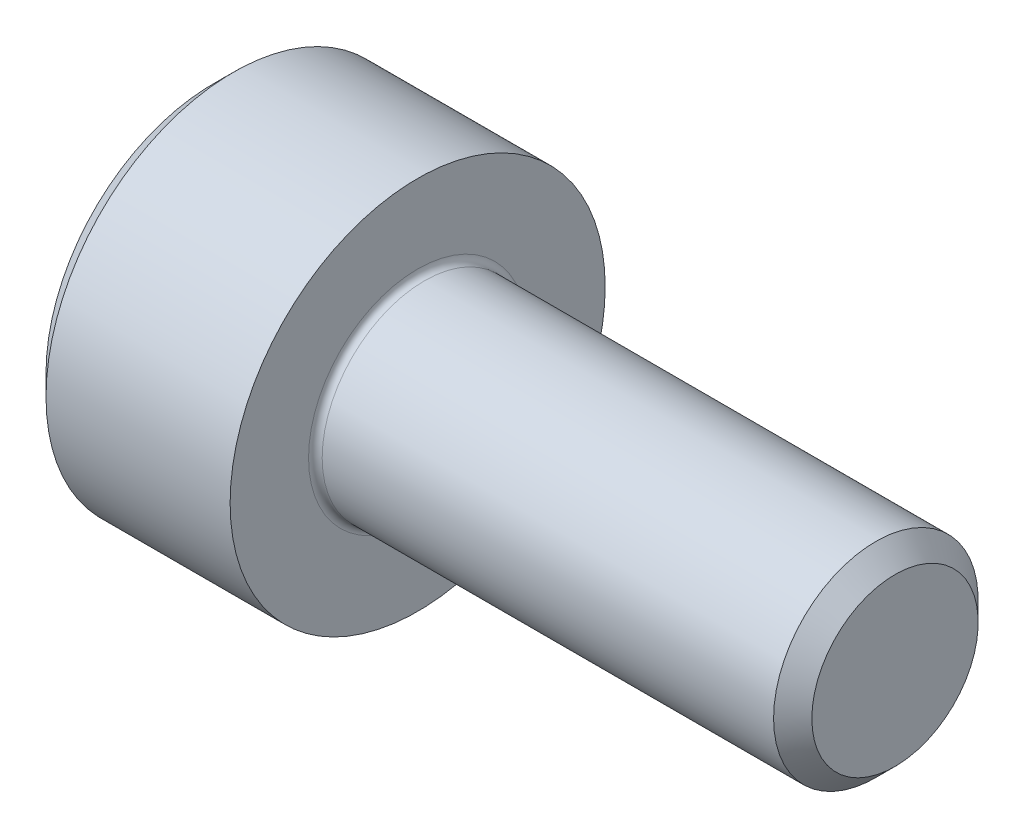
ISO-10303-21;
HEADER;
FILE_DESCRIPTION(('STEP AP214'),'2;1');
FILE_NAME('part.step','',(''),(''),'','','');
FILE_SCHEMA(('AUTOMOTIVE_DESIGN { 1 0 10303 214 1 1 1 1 }'));
ENDSEC;
DATA;
#1=APPLICATION_CONTEXT('core data for automotive mechanical design processes');
#2=APPLICATION_PROTOCOL_DEFINITION('international standard','automotive_design',2000,#1);
#3=PRODUCT_CONTEXT('',#1,'mechanical');
#4=PRODUCT('Part','Part','',(#3));
#5=PRODUCT_RELATED_PRODUCT_CATEGORY('part','',(#4));
#6=PRODUCT_DEFINITION_FORMATION('','',#4);
#7=PRODUCT_DEFINITION_CONTEXT('part definition',#1,'design');
#8=PRODUCT_DEFINITION('design','',#6,#7);
#9=PRODUCT_DEFINITION_SHAPE('','',#8);
#10=(LENGTH_UNIT() NAMED_UNIT(*) SI_UNIT(.MILLI.,.METRE.));
#11=(NAMED_UNIT(*) PLANE_ANGLE_UNIT() SI_UNIT($,.RADIAN.));
#12=(NAMED_UNIT(*) SI_UNIT($,.STERADIAN.) SOLID_ANGLE_UNIT());
#13=UNCERTAINTY_MEASURE_WITH_UNIT(LENGTH_MEASURE(1.E-05),#10,'distance_accuracy_value','');
#14=(GEOMETRIC_REPRESENTATION_CONTEXT(3) GLOBAL_UNCERTAINTY_ASSIGNED_CONTEXT((#13)) GLOBAL_UNIT_ASSIGNED_CONTEXT((#10,
#11,#12)) REPRESENTATION_CONTEXT('',''));
#15=CARTESIAN_POINT('',(0.,0.,0.));
#16=DIRECTION('',(0.,0.,1.));
#17=DIRECTION('',(1.,0.,0.));
#18=AXIS2_PLACEMENT_3D('',#15,#16,#17);
#19=CARTESIAN_POINT('',(0.,0.,0.));
#20=DIRECTION('',(-1.,0.,0.));
#21=DIRECTION('',(0.,0.,1.));
#22=AXIS2_PLACEMENT_3D('',#19,#20,#21);
#23=PLANE('',#22);
#24=DIRECTION('',(0.,-0.5,0.866025403784439));
#25=VECTOR('',#24,1.);
#26=CARTESIAN_POINT('',(0.,1.47801668912544,0.));
#27=LINE('',#26,#25);
#28=CARTESIAN_POINT('',(0.,1.47801668912544,0.));
#29=VERTEX_POINT('',#28);
#30=CARTESIAN_POINT('',(0.,0.739008344562719,1.28));
#31=VERTEX_POINT('',#30);
#32=EDGE_CURVE('E261',#29,#31,#27,.T.);
#33=ORIENTED_EDGE('',*,*,#32,.T.);
#34=DIRECTION('',(0.,1.,0.));
#35=VECTOR('',#34,1.);
#36=CARTESIAN_POINT('',(0.,-0.739008344562723,1.28));
#37=LINE('',#36,#35);
#38=CARTESIAN_POINT('',(0.,-0.739008344562723,1.28));
#39=VERTEX_POINT('',#38);
#40=EDGE_CURVE('E132',#39,#31,#37,.T.);
#41=ORIENTED_EDGE('',*,*,#40,.F.);
#42=DIRECTION('',(0.,-0.500000000000001,-0.866025403784438));
#43=VECTOR('',#42,1.);
#44=CARTESIAN_POINT('',(0.,-0.739008344562723,1.28));
#45=LINE('',#44,#43);
#46=CARTESIAN_POINT('',(0.,-1.47801668912545,0.));
#47=VERTEX_POINT('',#46);
#48=EDGE_CURVE('E264',#39,#47,#45,.T.);
#49=ORIENTED_EDGE('',*,*,#48,.T.);
#50=DIRECTION('',(0.,0.5,-0.866025403784439));
#51=VECTOR('',#50,1.);
#52=CARTESIAN_POINT('',(0.,-1.47801668912545,0.));
#53=LINE('',#52,#51);
#54=CARTESIAN_POINT('',(0.,-0.739008344562725,-1.28));
#55=VERTEX_POINT('',#54);
#56=EDGE_CURVE('E267',#47,#55,#53,.T.);
#57=ORIENTED_EDGE('',*,*,#56,.T.);
#58=DIRECTION('',(0.,-1.,0.));
#59=VECTOR('',#58,1.);
#60=CARTESIAN_POINT('',(0.,0.739008344562717,-1.28));
#61=LINE('',#60,#59);
#62=CARTESIAN_POINT('',(0.,0.739008344562717,-1.28));
#63=VERTEX_POINT('',#62);
#64=EDGE_CURVE('E270',#63,#55,#61,.T.);
#65=ORIENTED_EDGE('',*,*,#64,.F.);
#66=DIRECTION('',(0.,-0.500000000000001,-0.866025403784438));
#67=VECTOR('',#66,1.);
#68=CARTESIAN_POINT('',(0.,1.47801668912544,0.));
#69=LINE('',#68,#67);
#70=EDGE_CURVE('E127',#29,#63,#69,.T.);
#71=ORIENTED_EDGE('',*,*,#70,.F.);
#72=EDGE_LOOP('',(#33,#41,#49,#57,#65,#71));
#73=FACE_BOUND('',#72,.T.);
#74=CARTESIAN_POINT('',(0.,0.,0.));
#75=DIRECTION('',(-1.,0.,0.));
#76=DIRECTION('',(0.,0.,1.));
#77=AXIS2_PLACEMENT_3D('',#74,#75,#76);
#78=CIRCLE('',#77,2.45);
#79=CARTESIAN_POINT('',(0.,0.,2.45));
#80=VERTEX_POINT('',#79);
#81=EDGE_CURVE('E156',#80,#80,#78,.T.);
#82=ORIENTED_EDGE('',*,*,#81,.T.);
#83=EDGE_LOOP('',(#82));
#84=FACE_BOUND('',#83,.T.);
#85=ADVANCED_FACE('F36',(#73,#84),#23,.T.);
#86=CARTESIAN_POINT('',(0.,0.,0.));
#87=DIRECTION('',(1.,0.,0.));
#88=DIRECTION('',(0.,0.,-1.));
#89=AXIS2_PLACEMENT_3D('',#86,#87,#88);
#90=CONICAL_SURFACE('',#89,2.45,0.785398163397447);
#91=CARTESIAN_POINT('',(0.300000000000002,0.,0.));
#92=DIRECTION('',(-1.,0.,0.));
#93=DIRECTION('',(0.,0.,1.));
#94=AXIS2_PLACEMENT_3D('',#91,#92,#93);
#95=CIRCLE('',#94,2.75);
#96=CARTESIAN_POINT('',(0.300000000000002,0.,2.75));
#97=VERTEX_POINT('',#96);
#98=EDGE_CURVE('E153',#97,#97,#95,.T.);
#99=ORIENTED_EDGE('',*,*,#98,.T.);
#100=EDGE_LOOP('',(#99));
#101=FACE_BOUND('',#100,.T.);
#102=ORIENTED_EDGE('',*,*,#81,.F.);
#103=EDGE_LOOP('',(#102));
#104=FACE_BOUND('',#103,.T.);
#105=ADVANCED_FACE('F177',(#101,#104),#90,.T.);
#106=CARTESIAN_POINT('',(-31.75,0.,0.));
#107=DIRECTION('',(-1.,0.,0.));
#108=DIRECTION('',(0.,0.,1.));
#109=AXIS2_PLACEMENT_3D('',#106,#107,#108);
#110=CYLINDRICAL_SURFACE('',#109,2.75);
#111=CARTESIAN_POINT('',(3.,0.,0.));
#112=DIRECTION('',(-1.,0.,0.));
#113=DIRECTION('',(0.,0.,1.));
#114=AXIS2_PLACEMENT_3D('',#111,#112,#113);
#115=CIRCLE('',#114,2.75);
#116=CARTESIAN_POINT('',(3.,0.,2.75));
#117=VERTEX_POINT('',#116);
#118=EDGE_CURVE('E150',#117,#117,#115,.T.);
#119=ORIENTED_EDGE('',*,*,#118,.T.);
#120=EDGE_LOOP('',(#119));
#121=FACE_BOUND('',#120,.T.);
#122=ORIENTED_EDGE('',*,*,#98,.F.);
#123=EDGE_LOOP('',(#122));
#124=FACE_BOUND('',#123,.T.);
#125=ADVANCED_FACE('F182',(#121,#124),#110,.T.);
#126=CARTESIAN_POINT('',(3.,2.75,0.));
#127=DIRECTION('',(1.,0.,0.));
#128=DIRECTION('',(0.,0.,-1.));
#129=AXIS2_PLACEMENT_3D('',#126,#127,#128);
#130=PLANE('',#129);
#131=CARTESIAN_POINT('',(3.,0.,0.));
#132=DIRECTION('',(1.,0.,0.));
#133=DIRECTION('',(0.,0.,-1.));
#134=AXIS2_PLACEMENT_3D('',#131,#132,#133);
#135=CIRCLE('',#134,1.59999999999997);
#136=CARTESIAN_POINT('',(3.,0.,-1.59999999999997));
#137=VERTEX_POINT('',#136);
#138=EDGE_CURVE('E44',#137,#137,#135,.F.);
#139=ORIENTED_EDGE('',*,*,#138,.T.);
#140=EDGE_LOOP('',(#139));
#141=FACE_BOUND('',#140,.T.);
#142=ORIENTED_EDGE('',*,*,#118,.F.);
#143=EDGE_LOOP('',(#142));
#144=FACE_BOUND('',#143,.T.);
#145=ADVANCED_FACE('F161',(#141,#144),#130,.T.);
#146=CARTESIAN_POINT('',(-31.75,0.,0.));
#147=DIRECTION('',(-1.,0.,0.));
#148=DIRECTION('',(0.,0.,1.));
#149=AXIS2_PLACEMENT_3D('',#146,#147,#148);
#150=CYLINDRICAL_SURFACE('',#149,1.49999999999997);
#151=CARTESIAN_POINT('',(3.1,0.,0.));
#152=DIRECTION('',(1.,0.,0.));
#153=DIRECTION('',(0.,0.,-1.));
#154=AXIS2_PLACEMENT_3D('',#151,#152,#153);
#155=CIRCLE('',#154,1.49999999999997);
#156=CARTESIAN_POINT('',(3.1,0.,-1.49999999999997));
#157=VERTEX_POINT('',#156);
#158=EDGE_CURVE('E11',#157,#157,#155,.T.);
#159=ORIENTED_EDGE('',*,*,#158,.T.);
#160=EDGE_LOOP('',(#159));
#161=FACE_BOUND('',#160,.T.);
#162=CARTESIAN_POINT('',(9.71949999999995,0.,0.));
#163=DIRECTION('',(-1.,0.,0.));
#164=DIRECTION('',(0.,0.,1.));
#165=AXIS2_PLACEMENT_3D('',#162,#163,#164);
#166=CIRCLE('',#165,1.49999999999994);
#167=CARTESIAN_POINT('',(9.71949999999995,0.,1.49999999999994));
#168=VERTEX_POINT('',#167);
#169=EDGE_CURVE('E147',#168,#168,#166,.T.);
#170=ORIENTED_EDGE('',*,*,#169,.T.);
#171=EDGE_LOOP('',(#170));
#172=FACE_BOUND('',#171,.T.);
#173=ADVANCED_FACE('F192',(#161,#172),#150,.T.);
#174=CARTESIAN_POINT('',(10.,0.,0.));
#175=DIRECTION('',(-1.,0.,0.));
#176=DIRECTION('',(0.,0.,1.));
#177=AXIS2_PLACEMENT_3D('',#174,#175,#176);
#178=CONICAL_SURFACE('',#177,1.2195,0.785398163397248);
#179=ORIENTED_EDGE('',*,*,#169,.F.);
#180=EDGE_LOOP('',(#179));
#181=FACE_BOUND('',#180,.T.);
#182=CARTESIAN_POINT('',(10.,0.,0.));
#183=DIRECTION('',(-1.,0.,0.));
#184=DIRECTION('',(0.,0.,1.));
#185=AXIS2_PLACEMENT_3D('',#182,#183,#184);
#186=CIRCLE('',#185,1.2195);
#187=CARTESIAN_POINT('',(10.,0.,1.2195));
#188=VERTEX_POINT('',#187);
#189=EDGE_CURVE('E143',#188,#188,#186,.T.);
#190=ORIENTED_EDGE('',*,*,#189,.T.);
#191=EDGE_LOOP('',(#190));
#192=FACE_BOUND('',#191,.T.);
#193=ADVANCED_FACE('F172',(#181,#192),#178,.T.);
#194=CARTESIAN_POINT('',(10.,1.2195,0.));
#195=DIRECTION('',(1.,0.,0.));
#196=DIRECTION('',(0.,0.,-1.));
#197=AXIS2_PLACEMENT_3D('',#194,#195,#196);
#198=PLANE('',#197);
#199=ORIENTED_EDGE('',*,*,#189,.F.);
#200=EDGE_LOOP('',(#199));
#201=FACE_BOUND('',#200,.T.);
#202=ADVANCED_FACE('F165',(#201),#198,.T.);
#203=CARTESIAN_POINT('',(3.1,0.,0.));
#204=DIRECTION('',(1.,0.,0.));
#205=DIRECTION('',(0.,0.,-1.));
#206=AXIS2_PLACEMENT_3D('',#203,#204,#205);
#207=TOROIDAL_SURFACE('',#206,1.59999999999997,0.1);
#208=ORIENTED_EDGE('',*,*,#158,.F.);
#209=EDGE_LOOP('',(#208));
#210=FACE_BOUND('',#209,.T.);
#211=ORIENTED_EDGE('',*,*,#138,.F.);
#212=EDGE_LOOP('',(#211));
#213=FACE_BOUND('',#212,.T.);
#214=ADVANCED_FACE('F38',(#210,#213),#207,.F.);
#215=CARTESIAN_POINT('',(1.3,1.47801668912544,0.));
#216=DIRECTION('',(0.,-0.866025403784439,-0.5));
#217=DIRECTION('',(0.,0.5,-0.866025403784439));
#218=AXIS2_PLACEMENT_3D('',#215,#216,#217);
#219=PLANE('',#218);
#220=ORIENTED_EDGE('',*,*,#32,.F.);
#221=DIRECTION('',(-1.,0.,0.));
#222=VECTOR('',#221,1.);
#223=CARTESIAN_POINT('',(1.3,1.47801668912544,0.));
#224=LINE('',#223,#222);
#225=CARTESIAN_POINT('',(1.3,1.47801668912544,0.));
#226=VERTEX_POINT('',#225);
#227=EDGE_CURVE('E251',#226,#29,#224,.T.);
#228=ORIENTED_EDGE('',*,*,#227,.F.);
#229=DIRECTION('',(0.,-0.5,0.866025403784439));
#230=VECTOR('',#229,1.);
#231=CARTESIAN_POINT('',(1.3,1.47801668912544,0.));
#232=LINE('',#231,#230);
#233=CARTESIAN_POINT('',(1.3,1.10851251684408,0.639999999999998));
#234=VERTEX_POINT('',#233);
#235=EDGE_CURVE('E119',#226,#234,#232,.T.);
#236=ORIENTED_EDGE('',*,*,#235,.T.);
#237=CARTESIAN_POINT('',(1.3,0.739008344562719,1.28));
#238=VERTEX_POINT('',#237);
#239=EDGE_CURVE('E110',#234,#238,#232,.T.);
#240=ORIENTED_EDGE('',*,*,#239,.T.);
#241=DIRECTION('',(-1.,0.,0.));
#242=VECTOR('',#241,1.);
#243=CARTESIAN_POINT('',(1.3,0.739008344562719,1.28));
#244=LINE('',#243,#242);
#245=EDGE_CURVE('E124',#238,#31,#244,.T.);
#246=ORIENTED_EDGE('',*,*,#245,.T.);
#247=EDGE_LOOP('',(#220,#228,#236,#240,#246));
#248=FACE_BOUND('',#247,.T.);
#249=ADVANCED_FACE('F123',(#248),#219,.T.);
#250=CARTESIAN_POINT('',(1.3,-0.739008344562723,1.28));
#251=DIRECTION('',(0.,0.,1.));
#252=DIRECTION('',(0.,-1.,0.));
#253=AXIS2_PLACEMENT_3D('',#250,#251,#252);
#254=PLANE('',#253);
#255=ORIENTED_EDGE('',*,*,#40,.T.);
#256=ORIENTED_EDGE('',*,*,#245,.F.);
#257=DIRECTION('',(0.,1.,0.));
#258=VECTOR('',#257,1.);
#259=CARTESIAN_POINT('',(1.3,-0.739008344562723,1.28));
#260=LINE('',#259,#258);
#261=CARTESIAN_POINT('',(1.3,0.,1.28));
#262=VERTEX_POINT('',#261);
#263=EDGE_CURVE('E107',#262,#238,#260,.T.);
#264=ORIENTED_EDGE('',*,*,#263,.F.);
#265=CARTESIAN_POINT('',(1.3,-0.739008344562723,1.28));
#266=VERTEX_POINT('',#265);
#267=EDGE_CURVE('E118',#266,#262,#260,.T.);
#268=ORIENTED_EDGE('',*,*,#267,.F.);
#269=DIRECTION('',(-1.,0.,0.));
#270=VECTOR('',#269,1.);
#271=CARTESIAN_POINT('',(1.3,-0.739008344562723,1.28));
#272=LINE('',#271,#270);
#273=EDGE_CURVE('E134',#266,#39,#272,.T.);
#274=ORIENTED_EDGE('',*,*,#273,.T.);
#275=EDGE_LOOP('',(#255,#256,#264,#268,#274));
#276=FACE_BOUND('',#275,.T.);
#277=ADVANCED_FACE('F129',(#276),#254,.F.);
#278=CARTESIAN_POINT('',(1.3,-0.739008344562723,1.28));
#279=DIRECTION('',(0.,0.866025403784438,-0.500000000000001));
#280=DIRECTION('',(0.,0.500000000000001,0.866025403784438));
#281=AXIS2_PLACEMENT_3D('',#278,#279,#280);
#282=PLANE('',#281);
#283=ORIENTED_EDGE('',*,*,#48,.F.);
#284=ORIENTED_EDGE('',*,*,#273,.F.);
#285=DIRECTION('',(0.,-0.500000000000001,-0.866025403784438));
#286=VECTOR('',#285,1.);
#287=CARTESIAN_POINT('',(1.3,-0.739008344562723,1.28));
#288=LINE('',#287,#286);
#289=CARTESIAN_POINT('',(1.3,-1.10851251684408,0.640000000000003));
#290=VERTEX_POINT('',#289);
#291=EDGE_CURVE('E290',#266,#290,#288,.T.);
#292=ORIENTED_EDGE('',*,*,#291,.T.);
#293=CARTESIAN_POINT('',(1.3,-1.47801668912545,0.));
#294=VERTEX_POINT('',#293);
#295=EDGE_CURVE('E279',#290,#294,#288,.T.);
#296=ORIENTED_EDGE('',*,*,#295,.T.);
#297=DIRECTION('',(-1.,0.,0.));
#298=VECTOR('',#297,1.);
#299=CARTESIAN_POINT('',(1.3,-1.47801668912545,0.));
#300=LINE('',#299,#298);
#301=EDGE_CURVE('E139',#294,#47,#300,.T.);
#302=ORIENTED_EDGE('',*,*,#301,.T.);
#303=EDGE_LOOP('',(#283,#284,#292,#296,#302));
#304=FACE_BOUND('',#303,.T.);
#305=ADVANCED_FACE('F205',(#304),#282,.T.);
#306=CARTESIAN_POINT('',(1.3,-1.47801668912545,0.));
#307=DIRECTION('',(0.,0.866025403784439,0.5));
#308=DIRECTION('',(0.,-0.5,0.866025403784439));
#309=AXIS2_PLACEMENT_3D('',#306,#307,#308);
#310=PLANE('',#309);
#311=ORIENTED_EDGE('',*,*,#56,.F.);
#312=ORIENTED_EDGE('',*,*,#301,.F.);
#313=DIRECTION('',(0.,0.5,-0.866025403784439));
#314=VECTOR('',#313,1.);
#315=CARTESIAN_POINT('',(1.3,-1.47801668912545,0.));
#316=LINE('',#315,#314);
#317=CARTESIAN_POINT('',(1.3,-1.10851251684409,-0.640000000000002));
#318=VERTEX_POINT('',#317);
#319=EDGE_CURVE('E257',#294,#318,#316,.T.);
#320=ORIENTED_EDGE('',*,*,#319,.T.);
#321=CARTESIAN_POINT('',(1.3,-0.739008344562725,-1.28));
#322=VERTEX_POINT('',#321);
#323=EDGE_CURVE('E289',#318,#322,#316,.T.);
#324=ORIENTED_EDGE('',*,*,#323,.T.);
#325=DIRECTION('',(-1.,0.,0.));
#326=VECTOR('',#325,1.);
#327=CARTESIAN_POINT('',(1.3,-0.739008344562725,-1.28));
#328=LINE('',#327,#326);
#329=EDGE_CURVE('E250',#322,#55,#328,.T.);
#330=ORIENTED_EDGE('',*,*,#329,.T.);
#331=EDGE_LOOP('',(#311,#312,#320,#324,#330));
#332=FACE_BOUND('',#331,.T.);
#333=ADVANCED_FACE('F208',(#332),#310,.T.);
#334=CARTESIAN_POINT('',(1.3,0.739008344562717,-1.28));
#335=DIRECTION('',(0.,0.,-1.));
#336=DIRECTION('',(0.,1.,0.));
#337=AXIS2_PLACEMENT_3D('',#334,#335,#336);
#338=PLANE('',#337);
#339=ORIENTED_EDGE('',*,*,#64,.T.);
#340=ORIENTED_EDGE('',*,*,#329,.F.);
#341=DIRECTION('',(0.,-1.,0.));
#342=VECTOR('',#341,1.);
#343=CARTESIAN_POINT('',(1.3,0.739008344562717,-1.28));
#344=LINE('',#343,#342);
#345=CARTESIAN_POINT('',(1.3,0.,-1.28));
#346=VERTEX_POINT('',#345);
#347=EDGE_CURVE('E254',#346,#322,#344,.T.);
#348=ORIENTED_EDGE('',*,*,#347,.F.);
#349=CARTESIAN_POINT('',(1.3,0.739008344562717,-1.28));
#350=VERTEX_POINT('',#349);
#351=EDGE_CURVE('E51',#350,#346,#344,.T.);
#352=ORIENTED_EDGE('',*,*,#351,.F.);
#353=DIRECTION('',(-1.,0.,0.));
#354=VECTOR('',#353,1.);
#355=CARTESIAN_POINT('',(1.3,0.739008344562717,-1.28));
#356=LINE('',#355,#354);
#357=EDGE_CURVE('E247',#350,#63,#356,.T.);
#358=ORIENTED_EDGE('',*,*,#357,.T.);
#359=EDGE_LOOP('',(#339,#340,#348,#352,#358));
#360=FACE_BOUND('',#359,.T.);
#361=ADVANCED_FACE('F212',(#360),#338,.F.);
#362=CARTESIAN_POINT('',(1.3,1.47801668912544,0.));
#363=DIRECTION('',(0.,0.866025403784438,-0.500000000000001));
#364=DIRECTION('',(0.,0.500000000000001,0.866025403784438));
#365=AXIS2_PLACEMENT_3D('',#362,#363,#364);
#366=PLANE('',#365);
#367=ORIENTED_EDGE('',*,*,#70,.T.);
#368=ORIENTED_EDGE('',*,*,#357,.F.);
#369=DIRECTION('',(0.,-0.500000000000001,-0.866025403784438));
#370=VECTOR('',#369,1.);
#371=CARTESIAN_POINT('',(1.3,1.47801668912544,0.));
#372=LINE('',#371,#370);
#373=CARTESIAN_POINT('',(1.3,1.10851251684408,-0.640000000000001));
#374=VERTEX_POINT('',#373);
#375=EDGE_CURVE('E237',#374,#350,#372,.T.);
#376=ORIENTED_EDGE('',*,*,#375,.F.);
#377=EDGE_CURVE('E243',#226,#374,#372,.T.);
#378=ORIENTED_EDGE('',*,*,#377,.F.);
#379=ORIENTED_EDGE('',*,*,#227,.T.);
#380=EDGE_LOOP('',(#367,#368,#376,#378,#379));
#381=FACE_BOUND('',#380,.T.);
#382=ADVANCED_FACE('F216',(#381),#366,.F.);
#383=CARTESIAN_POINT('',(1.3,1.47801668912544,0.));
#384=DIRECTION('',(1.,0.,0.));
#385=DIRECTION('',(0.,0.,-1.));
#386=AXIS2_PLACEMENT_3D('',#383,#384,#385);
#387=PLANE('',#386);
#388=ORIENTED_EDGE('',*,*,#347,.T.);
#389=ORIENTED_EDGE('',*,*,#323,.F.);
#390=CARTESIAN_POINT('',(1.3,0.,0.));
#391=DIRECTION('',(-1.,0.,0.));
#392=DIRECTION('',(0.,0.,1.));
#393=AXIS2_PLACEMENT_3D('',#390,#391,#392);
#394=CIRCLE('',#393,1.28);
#395=EDGE_CURVE('E285',#346,#318,#394,.T.);
#396=ORIENTED_EDGE('',*,*,#395,.F.);
#397=EDGE_LOOP('',(#388,#389,#396));
#398=FACE_BOUND('',#397,.T.);
#399=ADVANCED_FACE('F220',(#398),#387,.F.);
#400=ORIENTED_EDGE('',*,*,#319,.F.);
#401=ORIENTED_EDGE('',*,*,#295,.F.);
#402=EDGE_CURVE('E137',#318,#290,#394,.T.);
#403=ORIENTED_EDGE('',*,*,#402,.F.);
#404=EDGE_LOOP('',(#400,#401,#403));
#405=FACE_BOUND('',#404,.T.);
#406=ADVANCED_FACE('F223',(#405),#387,.F.);
#407=ORIENTED_EDGE('',*,*,#291,.F.);
#408=ORIENTED_EDGE('',*,*,#267,.T.);
#409=EDGE_CURVE('E133',#290,#262,#394,.T.);
#410=ORIENTED_EDGE('',*,*,#409,.F.);
#411=EDGE_LOOP('',(#407,#408,#410));
#412=FACE_BOUND('',#411,.T.);
#413=ADVANCED_FACE('F228',(#412),#387,.F.);
#414=ORIENTED_EDGE('',*,*,#263,.T.);
#415=ORIENTED_EDGE('',*,*,#239,.F.);
#416=EDGE_CURVE('E113',#262,#234,#394,.T.);
#417=ORIENTED_EDGE('',*,*,#416,.F.);
#418=EDGE_LOOP('',(#414,#415,#417));
#419=FACE_BOUND('',#418,.T.);
#420=ADVANCED_FACE('F109',(#419),#387,.F.);
#421=ORIENTED_EDGE('',*,*,#235,.F.);
#422=ORIENTED_EDGE('',*,*,#377,.T.);
#423=EDGE_CURVE('E144',#234,#374,#394,.T.);
#424=ORIENTED_EDGE('',*,*,#423,.F.);
#425=EDGE_LOOP('',(#421,#422,#424));
#426=FACE_BOUND('',#425,.T.);
#427=ADVANCED_FACE('F231',(#426),#387,.F.);
#428=ORIENTED_EDGE('',*,*,#375,.T.);
#429=ORIENTED_EDGE('',*,*,#351,.T.);
#430=EDGE_CURVE('E240',#374,#346,#394,.T.);
#431=ORIENTED_EDGE('',*,*,#430,.F.);
#432=EDGE_LOOP('',(#428,#429,#431));
#433=FACE_BOUND('',#432,.T.);
#434=ADVANCED_FACE('F201',(#433),#387,.F.);
#435=CARTESIAN_POINT('',(1.3,0.,0.));
#436=DIRECTION('',(-1.,0.,0.));
#437=DIRECTION('',(0.,0.,1.));
#438=AXIS2_PLACEMENT_3D('',#435,#436,#437);
#439=CONICAL_SURFACE('',#438,1.28,1.0471975511966);
#440=CARTESIAN_POINT('',(2.03900834456273,0.,0.));
#441=VERTEX_POINT('',#440);
#442=VERTEX_LOOP('',#441);
#443=FACE_BOUND('',#442,.T.);
#444=ORIENTED_EDGE('',*,*,#416,.T.);
#445=ORIENTED_EDGE('',*,*,#423,.T.);
#446=ORIENTED_EDGE('',*,*,#430,.T.);
#447=ORIENTED_EDGE('',*,*,#395,.T.);
#448=ORIENTED_EDGE('',*,*,#402,.T.);
#449=ORIENTED_EDGE('',*,*,#409,.T.);
#450=EDGE_LOOP('',(#444,#445,#446,#447,#448,#449));
#451=FACE_BOUND('',#450,.T.);
#452=ADVANCED_FACE('F199',(#443,#451),#439,.F.);
#453=CLOSED_SHELL('',(#85,#105,#125,#145,#173,#193,#202,#214,#249,#277,#305,#333,#361,#382,#399,
#406,#413,#420,#427,#434,#452));
#454=MANIFOLD_SOLID_BREP('B2',#453);
#455=ADVANCED_BREP_SHAPE_REPRESENTATION('',(#18,#454),#14);
#456=SHAPE_DEFINITION_REPRESENTATION(#9,#455);
ENDSEC;
END-ISO-10303-21;
